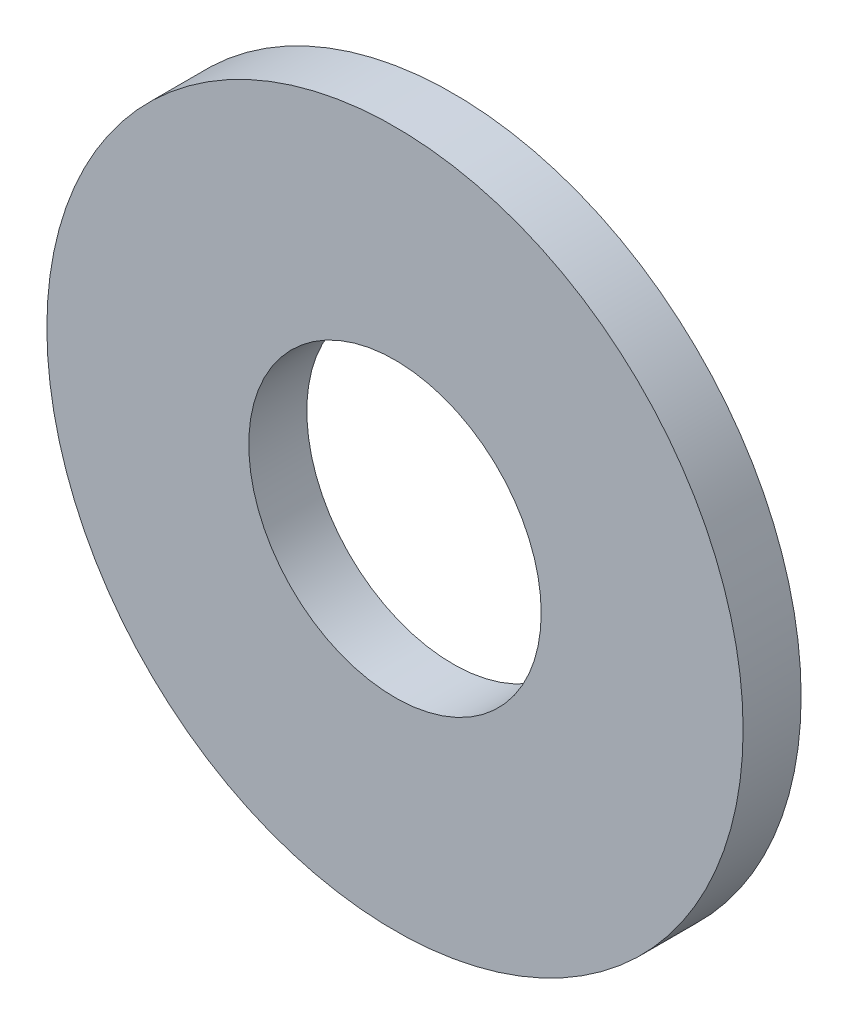
ISO-10303-21;
HEADER;
FILE_DESCRIPTION(('STEP AP214'),'2;1');
FILE_NAME('part.step','',(''),(''),'','','');
FILE_SCHEMA(('AUTOMOTIVE_DESIGN { 1 0 10303 214 1 1 1 1 }'));
ENDSEC;
DATA;
#1=APPLICATION_CONTEXT('core data for automotive mechanical design processes');
#2=APPLICATION_PROTOCOL_DEFINITION('international standard','automotive_design',2000,#1);
#3=PRODUCT_CONTEXT('',#1,'mechanical');
#4=PRODUCT('Part','Part','',(#3));
#5=PRODUCT_RELATED_PRODUCT_CATEGORY('part','',(#4));
#6=PRODUCT_DEFINITION_FORMATION('','',#4);
#7=PRODUCT_DEFINITION_CONTEXT('part definition',#1,'design');
#8=PRODUCT_DEFINITION('design','',#6,#7);
#9=PRODUCT_DEFINITION_SHAPE('','',#8);
#10=(LENGTH_UNIT() NAMED_UNIT(*) SI_UNIT(.MILLI.,.METRE.));
#11=(NAMED_UNIT(*) PLANE_ANGLE_UNIT() SI_UNIT($,.RADIAN.));
#12=(NAMED_UNIT(*) SI_UNIT($,.STERADIAN.) SOLID_ANGLE_UNIT());
#13=UNCERTAINTY_MEASURE_WITH_UNIT(LENGTH_MEASURE(1.E-05),#10,'distance_accuracy_value','');
#14=(GEOMETRIC_REPRESENTATION_CONTEXT(3) GLOBAL_UNCERTAINTY_ASSIGNED_CONTEXT((#13)) GLOBAL_UNIT_ASSIGNED_CONTEXT((#10,
#11,#12)) REPRESENTATION_CONTEXT('',''));
#15=CARTESIAN_POINT('',(0.,0.,0.));
#16=DIRECTION('',(0.,0.,1.));
#17=DIRECTION('',(1.,0.,0.));
#18=AXIS2_PLACEMENT_3D('',#15,#16,#17);
#19=CARTESIAN_POINT('',(0.,0.,1.5875));
#20=DIRECTION('',(0.,0.,1.));
#21=DIRECTION('',(1.,0.,0.));
#22=AXIS2_PLACEMENT_3D('',#19,#20,#21);
#23=PLANE('',#22);
#24=CARTESIAN_POINT('',(0.,0.,1.5875));
#25=DIRECTION('',(0.,0.,1.));
#26=DIRECTION('',(1.,0.,0.));
#27=AXIS2_PLACEMENT_3D('',#24,#25,#26);
#28=CIRCLE('',#27,9.525);
#29=CARTESIAN_POINT('',(9.525,0.,1.5875));
#30=VERTEX_POINT('',#29);
#31=EDGE_CURVE('E10',#30,#30,#28,.T.);
#32=ORIENTED_EDGE('',*,*,#31,.T.);
#33=EDGE_LOOP('',(#32));
#34=FACE_BOUND('',#33,.T.);
#35=CARTESIAN_POINT('',(0.,0.,1.5875));
#36=DIRECTION('',(0.,0.,1.));
#37=DIRECTION('',(1.,0.,0.));
#38=AXIS2_PLACEMENT_3D('',#35,#36,#37);
#39=CIRCLE('',#38,4.0005);
#40=CARTESIAN_POINT('',(4.0005,0.,1.5875));
#41=VERTEX_POINT('',#40);
#42=EDGE_CURVE('E44',#41,#41,#39,.T.);
#43=ORIENTED_EDGE('',*,*,#42,.F.);
#44=EDGE_LOOP('',(#43));
#45=FACE_BOUND('',#44,.T.);
#46=ADVANCED_FACE('F33',(#34,#45),#23,.T.);
#47=CARTESIAN_POINT('',(0.,0.,0.));
#48=DIRECTION('',(0.,0.,1.));
#49=DIRECTION('',(1.,0.,0.));
#50=AXIS2_PLACEMENT_3D('',#47,#48,#49);
#51=PLANE('',#50);
#52=CARTESIAN_POINT('',(0.,0.,0.));
#53=DIRECTION('',(0.,0.,1.));
#54=DIRECTION('',(1.,0.,0.));
#55=AXIS2_PLACEMENT_3D('',#52,#53,#54);
#56=CIRCLE('',#55,9.525);
#57=CARTESIAN_POINT('',(9.525,0.,0.));
#58=VERTEX_POINT('',#57);
#59=EDGE_CURVE('E37',#58,#58,#56,.T.);
#60=ORIENTED_EDGE('',*,*,#59,.F.);
#61=EDGE_LOOP('',(#60));
#62=FACE_BOUND('',#61,.T.);
#63=CARTESIAN_POINT('',(0.,0.,0.));
#64=DIRECTION('',(0.,0.,1.));
#65=DIRECTION('',(1.,0.,0.));
#66=AXIS2_PLACEMENT_3D('',#63,#64,#65);
#67=CIRCLE('',#66,4.0005);
#68=CARTESIAN_POINT('',(4.0005,0.,0.));
#69=VERTEX_POINT('',#68);
#70=EDGE_CURVE('E46',#69,#69,#67,.T.);
#71=ORIENTED_EDGE('',*,*,#70,.T.);
#72=EDGE_LOOP('',(#71));
#73=FACE_BOUND('',#72,.T.);
#74=ADVANCED_FACE('F56',(#62,#73),#51,.F.);
#75=CARTESIAN_POINT('',(0.,0.,1.5875));
#76=DIRECTION('',(0.,0.,-1.));
#77=DIRECTION('',(-1.,0.,0.));
#78=AXIS2_PLACEMENT_3D('',#75,#76,#77);
#79=CYLINDRICAL_SURFACE('',#78,9.525);
#80=ORIENTED_EDGE('',*,*,#31,.F.);
#81=EDGE_LOOP('',(#80));
#82=FACE_BOUND('',#81,.T.);
#83=ORIENTED_EDGE('',*,*,#59,.T.);
#84=EDGE_LOOP('',(#83));
#85=FACE_BOUND('',#84,.T.);
#86=ADVANCED_FACE('F35',(#82,#85),#79,.T.);
#87=CARTESIAN_POINT('',(0.,0.,1.5875));
#88=DIRECTION('',(0.,0.,-1.));
#89=DIRECTION('',(-1.,0.,0.));
#90=AXIS2_PLACEMENT_3D('',#87,#88,#89);
#91=CYLINDRICAL_SURFACE('',#90,4.0005);
#92=ORIENTED_EDGE('',*,*,#42,.T.);
#93=EDGE_LOOP('',(#92));
#94=FACE_BOUND('',#93,.T.);
#95=ORIENTED_EDGE('',*,*,#70,.F.);
#96=EDGE_LOOP('',(#95));
#97=FACE_BOUND('',#96,.T.);
#98=ADVANCED_FACE('F52',(#94,#97),#91,.F.);
#99=CLOSED_SHELL('',(#46,#74,#86,#98));
#100=MANIFOLD_SOLID_BREP('B2',#99);
#101=ADVANCED_BREP_SHAPE_REPRESENTATION('',(#18,#100),#14);
#102=SHAPE_DEFINITION_REPRESENTATION(#9,#101);
ENDSEC;
END-ISO-10303-21;
